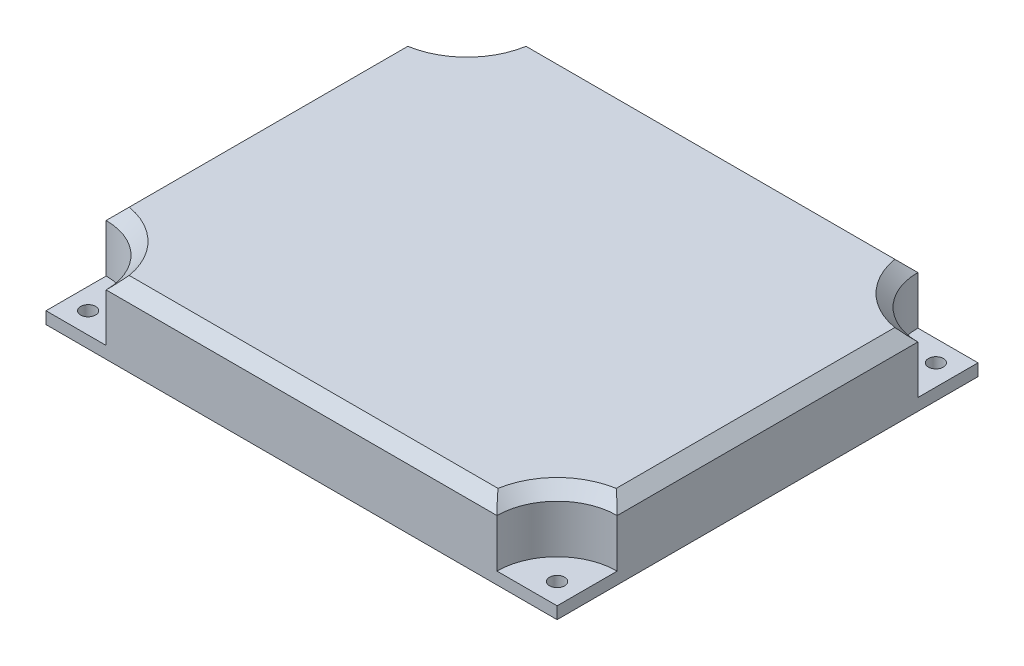
ISO-10303-21;
HEADER;
FILE_DESCRIPTION(('STEP AP214'),'2;1');
FILE_NAME('part.step','',(''),(''),'','','');
FILE_SCHEMA(('AUTOMOTIVE_DESIGN { 1 0 10303 214 1 1 1 1 }'));
ENDSEC;
DATA;
#1=APPLICATION_CONTEXT('core data for automotive mechanical design processes');
#2=APPLICATION_PROTOCOL_DEFINITION('international standard','automotive_design',2000,#1);
#3=PRODUCT_CONTEXT('',#1,'mechanical');
#4=PRODUCT('Part','Part','',(#3));
#5=PRODUCT_RELATED_PRODUCT_CATEGORY('part','',(#4));
#6=PRODUCT_DEFINITION_FORMATION('','',#4);
#7=PRODUCT_DEFINITION_CONTEXT('part definition',#1,'design');
#8=PRODUCT_DEFINITION('design','',#6,#7);
#9=PRODUCT_DEFINITION_SHAPE('','',#8);
#10=(LENGTH_UNIT() NAMED_UNIT(*) SI_UNIT(.MILLI.,.METRE.));
#11=(NAMED_UNIT(*) PLANE_ANGLE_UNIT() SI_UNIT($,.RADIAN.));
#12=(NAMED_UNIT(*) SI_UNIT($,.STERADIAN.) SOLID_ANGLE_UNIT());
#13=UNCERTAINTY_MEASURE_WITH_UNIT(LENGTH_MEASURE(1.E-05),#10,'distance_accuracy_value','');
#14=(GEOMETRIC_REPRESENTATION_CONTEXT(3) GLOBAL_UNCERTAINTY_ASSIGNED_CONTEXT((#13)) GLOBAL_UNIT_ASSIGNED_CONTEXT((#10,
#11,#12)) REPRESENTATION_CONTEXT('',''));
#15=CARTESIAN_POINT('',(0.,0.,0.));
#16=DIRECTION('',(0.,0.,1.));
#17=DIRECTION('',(1.,0.,0.));
#18=AXIS2_PLACEMENT_3D('',#15,#16,#17);
#19=CARTESIAN_POINT('',(42.5,12.,35.));
#20=DIRECTION('',(-1.,0.,0.));
#21=DIRECTION('',(0.,0.,1.));
#22=AXIS2_PLACEMENT_3D('',#19,#20,#21);
#23=PLANE('',#22);
#24=DIRECTION('',(0.,1.,0.));
#25=VECTOR('',#24,1.);
#26=CARTESIAN_POINT('',(42.5,2.,-25.));
#27=LINE('',#26,#25);
#28=CARTESIAN_POINT('',(42.5,10.,-25.));
#29=VERTEX_POINT('',#28);
#30=CARTESIAN_POINT('',(42.5,2.,-25.));
#31=VERTEX_POINT('',#30);
#32=EDGE_CURVE('E372',#29,#31,#27,.F.);
#33=ORIENTED_EDGE('',*,*,#32,.F.);
#34=DIRECTION('',(0.,0.,1.));
#35=VECTOR('',#34,1.);
#36=CARTESIAN_POINT('',(42.5,10.,35.));
#37=LINE('',#36,#35);
#38=CARTESIAN_POINT('',(42.5,10.,25.));
#39=VERTEX_POINT('',#38);
#40=EDGE_CURVE('E458',#29,#39,#37,.T.);
#41=ORIENTED_EDGE('',*,*,#40,.T.);
#42=DIRECTION('',(0.,1.,0.));
#43=VECTOR('',#42,1.);
#44=CARTESIAN_POINT('',(42.5,2.,25.));
#45=LINE('',#44,#43);
#46=CARTESIAN_POINT('',(42.5,2.,25.));
#47=VERTEX_POINT('',#46);
#48=EDGE_CURVE('E352',#39,#47,#45,.F.);
#49=ORIENTED_EDGE('',*,*,#48,.T.);
#50=DIRECTION('',(0.,0.,-1.));
#51=VECTOR('',#50,1.);
#52=CARTESIAN_POINT('',(42.5,2.,35.));
#53=LINE('',#52,#51);
#54=CARTESIAN_POINT('',(42.5,2.,35.));
#55=VERTEX_POINT('',#54);
#56=EDGE_CURVE('E375',#55,#47,#53,.T.);
#57=ORIENTED_EDGE('',*,*,#56,.F.);
#58=DIRECTION('',(0.,-1.,0.));
#59=VECTOR('',#58,1.);
#60=CARTESIAN_POINT('',(42.5,12.,35.));
#61=LINE('',#60,#59);
#62=CARTESIAN_POINT('',(42.5,0.,35.));
#63=VERTEX_POINT('',#62);
#64=EDGE_CURVE('E406',#55,#63,#61,.T.);
#65=ORIENTED_EDGE('',*,*,#64,.T.);
#66=DIRECTION('',(0.,0.,-1.));
#67=VECTOR('',#66,1.);
#68=CARTESIAN_POINT('',(42.5,0.,35.));
#69=LINE('',#68,#67);
#70=CARTESIAN_POINT('',(42.5,0.,-35.));
#71=VERTEX_POINT('',#70);
#72=EDGE_CURVE('E390',#63,#71,#69,.T.);
#73=ORIENTED_EDGE('',*,*,#72,.T.);
#74=DIRECTION('',(0.,-1.,0.));
#75=VECTOR('',#74,1.);
#76=CARTESIAN_POINT('',(42.5,12.,-35.));
#77=LINE('',#76,#75);
#78=CARTESIAN_POINT('',(42.5,2.,-35.));
#79=VERTEX_POINT('',#78);
#80=EDGE_CURVE('E415',#79,#71,#77,.T.);
#81=ORIENTED_EDGE('',*,*,#80,.F.);
#82=DIRECTION('',(0.,0.,1.));
#83=VECTOR('',#82,1.);
#84=CARTESIAN_POINT('',(42.5,2.,35.));
#85=LINE('',#84,#83);
#86=EDGE_CURVE('E386',#79,#31,#85,.T.);
#87=ORIENTED_EDGE('',*,*,#86,.T.);
#88=EDGE_LOOP('',(#33,#41,#49,#57,#65,#73,#81,#87));
#89=FACE_BOUND('',#88,.T.);
#90=ADVANCED_FACE('F43',(#89),#23,.F.);
#91=CARTESIAN_POINT('',(-42.5,12.,-35.));
#92=DIRECTION('',(0.,0.,1.));
#93=DIRECTION('',(1.,0.,0.));
#94=AXIS2_PLACEMENT_3D('',#91,#92,#93);
#95=PLANE('',#94);
#96=DIRECTION('',(0.,1.,0.));
#97=VECTOR('',#96,1.);
#98=CARTESIAN_POINT('',(-32.5,2.,-35.));
#99=LINE('',#98,#97);
#100=CARTESIAN_POINT('',(-32.5,10.,-35.));
#101=VERTEX_POINT('',#100);
#102=CARTESIAN_POINT('',(-32.5,2.,-35.));
#103=VERTEX_POINT('',#102);
#104=EDGE_CURVE('E366',#101,#103,#99,.F.);
#105=ORIENTED_EDGE('',*,*,#104,.F.);
#106=DIRECTION('',(1.,0.,0.));
#107=VECTOR('',#106,1.);
#108=CARTESIAN_POINT('',(-42.5,10.,-35.));
#109=LINE('',#108,#107);
#110=CARTESIAN_POINT('',(32.5,10.,-35.));
#111=VERTEX_POINT('',#110);
#112=EDGE_CURVE('E54',#101,#111,#109,.T.);
#113=ORIENTED_EDGE('',*,*,#112,.T.);
#114=DIRECTION('',(0.,1.,0.));
#115=VECTOR('',#114,1.);
#116=CARTESIAN_POINT('',(32.5,2.,-35.));
#117=LINE('',#116,#115);
#118=CARTESIAN_POINT('',(32.5,2.,-35.));
#119=VERTEX_POINT('',#118);
#120=EDGE_CURVE('E369',#119,#111,#117,.T.);
#121=ORIENTED_EDGE('',*,*,#120,.F.);
#122=DIRECTION('',(1.,0.,0.));
#123=VECTOR('',#122,1.);
#124=CARTESIAN_POINT('',(-42.5,2.,-35.));
#125=LINE('',#124,#123);
#126=EDGE_CURVE('E429',#119,#79,#125,.T.);
#127=ORIENTED_EDGE('',*,*,#126,.T.);
#128=ORIENTED_EDGE('',*,*,#80,.T.);
#129=DIRECTION('',(-1.,0.,0.));
#130=VECTOR('',#129,1.);
#131=CARTESIAN_POINT('',(-42.5,0.,-35.));
#132=LINE('',#131,#130);
#133=CARTESIAN_POINT('',(-42.5,0.,-35.));
#134=VERTEX_POINT('',#133);
#135=EDGE_CURVE('E394',#71,#134,#132,.T.);
#136=ORIENTED_EDGE('',*,*,#135,.T.);
#137=DIRECTION('',(0.,-1.,0.));
#138=VECTOR('',#137,1.);
#139=CARTESIAN_POINT('',(-42.5,12.,-35.));
#140=LINE('',#139,#138);
#141=CARTESIAN_POINT('',(-42.5,2.,-35.));
#142=VERTEX_POINT('',#141);
#143=EDGE_CURVE('E412',#142,#134,#140,.T.);
#144=ORIENTED_EDGE('',*,*,#143,.F.);
#145=DIRECTION('',(1.,0.,0.));
#146=VECTOR('',#145,1.);
#147=CARTESIAN_POINT('',(-42.5,2.,-35.));
#148=LINE('',#147,#146);
#149=EDGE_CURVE('E382',#142,#103,#148,.T.);
#150=ORIENTED_EDGE('',*,*,#149,.T.);
#151=EDGE_LOOP('',(#105,#113,#121,#127,#128,#136,#144,#150));
#152=FACE_BOUND('',#151,.T.);
#153=ADVANCED_FACE('F619',(#152),#95,.F.);
#154=CARTESIAN_POINT('',(-42.5,12.,35.));
#155=DIRECTION('',(1.,0.,0.));
#156=DIRECTION('',(0.,0.,-1.));
#157=AXIS2_PLACEMENT_3D('',#154,#155,#156);
#158=PLANE('',#157);
#159=DIRECTION('',(0.,1.,0.));
#160=VECTOR('',#159,1.);
#161=CARTESIAN_POINT('',(-42.5,2.,25.));
#162=LINE('',#161,#160);
#163=CARTESIAN_POINT('',(-42.5,2.,25.));
#164=VERTEX_POINT('',#163);
#165=CARTESIAN_POINT('',(-42.5,10.,25.));
#166=VERTEX_POINT('',#165);
#167=EDGE_CURVE('E358',#164,#166,#162,.T.);
#168=ORIENTED_EDGE('',*,*,#167,.T.);
#169=DIRECTION('',(0.,0.,-1.));
#170=VECTOR('',#169,1.);
#171=CARTESIAN_POINT('',(-42.5,10.,35.));
#172=LINE('',#171,#170);
#173=CARTESIAN_POINT('',(-42.5,10.,-25.));
#174=VERTEX_POINT('',#173);
#175=EDGE_CURVE('E471',#166,#174,#172,.T.);
#176=ORIENTED_EDGE('',*,*,#175,.T.);
#177=DIRECTION('',(0.,1.,0.));
#178=VECTOR('',#177,1.);
#179=CARTESIAN_POINT('',(-42.5,2.,-25.));
#180=LINE('',#179,#178);
#181=CARTESIAN_POINT('',(-42.5,2.,-25.));
#182=VERTEX_POINT('',#181);
#183=EDGE_CURVE('E362',#182,#174,#180,.T.);
#184=ORIENTED_EDGE('',*,*,#183,.F.);
#185=DIRECTION('',(0.,0.,-1.));
#186=VECTOR('',#185,1.);
#187=CARTESIAN_POINT('',(-42.5,2.,35.));
#188=LINE('',#187,#186);
#189=EDGE_CURVE('E425',#182,#142,#188,.T.);
#190=ORIENTED_EDGE('',*,*,#189,.T.);
#191=ORIENTED_EDGE('',*,*,#143,.T.);
#192=DIRECTION('',(0.,0.,1.));
#193=VECTOR('',#192,1.);
#194=CARTESIAN_POINT('',(-42.5,0.,35.));
#195=LINE('',#194,#193);
#196=CARTESIAN_POINT('',(-42.5,0.,35.));
#197=VERTEX_POINT('',#196);
#198=EDGE_CURVE('E398',#134,#197,#195,.T.);
#199=ORIENTED_EDGE('',*,*,#198,.T.);
#200=DIRECTION('',(0.,-1.,0.));
#201=VECTOR('',#200,1.);
#202=CARTESIAN_POINT('',(-42.5,12.,35.));
#203=LINE('',#202,#201);
#204=CARTESIAN_POINT('',(-42.5,2.,35.));
#205=VERTEX_POINT('',#204);
#206=EDGE_CURVE('E409',#205,#197,#203,.T.);
#207=ORIENTED_EDGE('',*,*,#206,.F.);
#208=DIRECTION('',(0.,0.,1.));
#209=VECTOR('',#208,1.);
#210=CARTESIAN_POINT('',(-42.5,2.,35.));
#211=LINE('',#210,#209);
#212=EDGE_CURVE('E379',#164,#205,#211,.T.);
#213=ORIENTED_EDGE('',*,*,#212,.F.);
#214=EDGE_LOOP('',(#168,#176,#184,#190,#191,#199,#207,#213));
#215=FACE_BOUND('',#214,.T.);
#216=ADVANCED_FACE('F639',(#215),#158,.F.);
#217=CARTESIAN_POINT('',(0.,12.,0.));
#218=DIRECTION('',(0.,-1.,0.));
#219=DIRECTION('',(0.,0.,-1.));
#220=AXIS2_PLACEMENT_3D('',#217,#218,#219);
#221=PLANE('',#220);
#222=CARTESIAN_POINT('',(42.5,12.,35.));
#223=DIRECTION('',(0.,-1.,0.));
#224=DIRECTION('',(0.,0.,-1.));
#225=AXIS2_PLACEMENT_3D('',#222,#223,#224);
#226=CIRCLE('',#225,12.);
#227=CARTESIAN_POINT('',(30.6678404338008,12.,33.));
#228=VERTEX_POINT('',#227);
#229=CARTESIAN_POINT('',(40.5,12.,23.1678404338008));
#230=VERTEX_POINT('',#229);
#231=EDGE_CURVE('E451',#228,#230,#226,.T.);
#232=ORIENTED_EDGE('',*,*,#231,.T.);
#233=DIRECTION('',(0.,0.,-1.));
#234=VECTOR('',#233,1.);
#235=CARTESIAN_POINT('',(40.5,12.,0.));
#236=LINE('',#235,#234);
#237=CARTESIAN_POINT('',(40.5,12.,-23.1678404338008));
#238=VERTEX_POINT('',#237);
#239=EDGE_CURVE('E454',#230,#238,#236,.T.);
#240=ORIENTED_EDGE('',*,*,#239,.T.);
#241=CARTESIAN_POINT('',(42.5,12.,-35.));
#242=DIRECTION('',(0.,-1.,0.));
#243=DIRECTION('',(0.,0.,-1.));
#244=AXIS2_PLACEMENT_3D('',#241,#242,#243);
#245=CIRCLE('',#244,12.);
#246=CARTESIAN_POINT('',(30.6678404338008,12.,-33.));
#247=VERTEX_POINT('',#246);
#248=EDGE_CURVE('E433',#238,#247,#245,.T.);
#249=ORIENTED_EDGE('',*,*,#248,.T.);
#250=DIRECTION('',(-1.,0.,0.));
#251=VECTOR('',#250,1.);
#252=CARTESIAN_POINT('',(0.,12.,-33.));
#253=LINE('',#252,#251);
#254=CARTESIAN_POINT('',(-30.6678404338008,12.,-33.));
#255=VERTEX_POINT('',#254);
#256=EDGE_CURVE('E436',#247,#255,#253,.T.);
#257=ORIENTED_EDGE('',*,*,#256,.T.);
#258=CARTESIAN_POINT('',(-42.5,12.,-35.));
#259=DIRECTION('',(0.,-1.,0.));
#260=DIRECTION('',(0.,0.,-1.));
#261=AXIS2_PLACEMENT_3D('',#258,#259,#260);
#262=CIRCLE('',#261,12.);
#263=CARTESIAN_POINT('',(-40.5,12.,-23.1678404338008));
#264=VERTEX_POINT('',#263);
#265=EDGE_CURVE('E439',#255,#264,#262,.T.);
#266=ORIENTED_EDGE('',*,*,#265,.T.);
#267=DIRECTION('',(0.,0.,1.));
#268=VECTOR('',#267,1.);
#269=CARTESIAN_POINT('',(-40.5,12.,0.));
#270=LINE('',#269,#268);
#271=CARTESIAN_POINT('',(-40.5,12.,23.1678404338008));
#272=VERTEX_POINT('',#271);
#273=EDGE_CURVE('E442',#264,#272,#270,.T.);
#274=ORIENTED_EDGE('',*,*,#273,.T.);
#275=CARTESIAN_POINT('',(-42.5,12.,35.));
#276=DIRECTION('',(0.,-1.,0.));
#277=DIRECTION('',(0.,0.,-1.));
#278=AXIS2_PLACEMENT_3D('',#275,#276,#277);
#279=CIRCLE('',#278,12.);
#280=CARTESIAN_POINT('',(-30.6678404338008,12.,33.));
#281=VERTEX_POINT('',#280);
#282=EDGE_CURVE('E445',#272,#281,#279,.T.);
#283=ORIENTED_EDGE('',*,*,#282,.T.);
#284=DIRECTION('',(1.,0.,0.));
#285=VECTOR('',#284,1.);
#286=CARTESIAN_POINT('',(0.,12.,33.));
#287=LINE('',#286,#285);
#288=EDGE_CURVE('E448',#281,#228,#287,.T.);
#289=ORIENTED_EDGE('',*,*,#288,.T.);
#290=EDGE_LOOP('',(#232,#240,#249,#257,#266,#274,#283,#289));
#291=FACE_BOUND('',#290,.T.);
#292=ADVANCED_FACE('F579',(#291),#221,.F.);
#293=CARTESIAN_POINT('',(-42.5,12.,35.));
#294=DIRECTION('',(0.,0.,-1.));
#295=DIRECTION('',(-1.,0.,0.));
#296=AXIS2_PLACEMENT_3D('',#293,#294,#295);
#297=PLANE('',#296);
#298=DIRECTION('',(0.,1.,0.));
#299=VECTOR('',#298,1.);
#300=CARTESIAN_POINT('',(32.5,2.,35.));
#301=LINE('',#300,#299);
#302=CARTESIAN_POINT('',(32.5,2.,35.));
#303=VERTEX_POINT('',#302);
#304=CARTESIAN_POINT('',(32.5,10.,35.));
#305=VERTEX_POINT('',#304);
#306=EDGE_CURVE('E348',#303,#305,#301,.T.);
#307=ORIENTED_EDGE('',*,*,#306,.T.);
#308=DIRECTION('',(-1.,0.,0.));
#309=VECTOR('',#308,1.);
#310=CARTESIAN_POINT('',(-42.5,10.,35.));
#311=LINE('',#310,#309);
#312=CARTESIAN_POINT('',(-32.5,10.,35.));
#313=VERTEX_POINT('',#312);
#314=EDGE_CURVE('E465',#305,#313,#311,.T.);
#315=ORIENTED_EDGE('',*,*,#314,.T.);
#316=DIRECTION('',(0.,1.,0.));
#317=VECTOR('',#316,1.);
#318=CARTESIAN_POINT('',(-32.5,2.,35.));
#319=LINE('',#318,#317);
#320=CARTESIAN_POINT('',(-32.5,2.,35.));
#321=VERTEX_POINT('',#320);
#322=EDGE_CURVE('E355',#313,#321,#319,.F.);
#323=ORIENTED_EDGE('',*,*,#322,.T.);
#324=DIRECTION('',(1.,0.,0.));
#325=VECTOR('',#324,1.);
#326=CARTESIAN_POINT('',(-42.5,2.,35.));
#327=LINE('',#326,#325);
#328=EDGE_CURVE('E421',#205,#321,#327,.T.);
#329=ORIENTED_EDGE('',*,*,#328,.F.);
#330=ORIENTED_EDGE('',*,*,#206,.T.);
#331=DIRECTION('',(1.,0.,0.));
#332=VECTOR('',#331,1.);
#333=CARTESIAN_POINT('',(-42.5,0.,35.));
#334=LINE('',#333,#332);
#335=EDGE_CURVE('E402',#197,#63,#334,.T.);
#336=ORIENTED_EDGE('',*,*,#335,.T.);
#337=ORIENTED_EDGE('',*,*,#64,.F.);
#338=DIRECTION('',(1.,0.,0.));
#339=VECTOR('',#338,1.);
#340=CARTESIAN_POINT('',(-42.5,2.,35.));
#341=LINE('',#340,#339);
#342=EDGE_CURVE('E418',#303,#55,#341,.T.);
#343=ORIENTED_EDGE('',*,*,#342,.F.);
#344=EDGE_LOOP('',(#307,#315,#323,#329,#330,#336,#337,#343));
#345=FACE_BOUND('',#344,.T.);
#346=ADVANCED_FACE('F609',(#345),#297,.F.);
#347=CARTESIAN_POINT('',(0.,0.,0.));
#348=DIRECTION('',(0.,-1.,0.));
#349=DIRECTION('',(0.,0.,-1.));
#350=AXIS2_PLACEMENT_3D('',#347,#348,#349);
#351=PLANE('',#350);
#352=CARTESIAN_POINT('',(34.95,0.,26.45));
#353=DIRECTION('',(0.,-1.,0.));
#354=DIRECTION('',(0.,0.,-1.));
#355=AXIS2_PLACEMENT_3D('',#352,#353,#354);
#356=CIRCLE('',#355,0.999999999999999);
#357=CARTESIAN_POINT('',(35.95,0.,26.45));
#358=VERTEX_POINT('',#357);
#359=CARTESIAN_POINT('',(34.95,0.,27.45));
#360=VERTEX_POINT('',#359);
#361=EDGE_CURVE('E62',#358,#360,#356,.T.);
#362=ORIENTED_EDGE('',*,*,#361,.F.);
#363=DIRECTION('',(0.,0.,1.));
#364=VECTOR('',#363,1.);
#365=CARTESIAN_POINT('',(35.95,0.,-26.45));
#366=LINE('',#365,#364);
#367=CARTESIAN_POINT('',(35.95,0.,-26.45));
#368=VERTEX_POINT('',#367);
#369=EDGE_CURVE('E232',#368,#358,#366,.T.);
#370=ORIENTED_EDGE('',*,*,#369,.F.);
#371=CARTESIAN_POINT('',(34.95,0.,-26.45));
#372=DIRECTION('',(0.,-1.,0.));
#373=DIRECTION('',(0.,0.,1.));
#374=AXIS2_PLACEMENT_3D('',#371,#372,#373);
#375=CIRCLE('',#374,0.999999999999999);
#376=CARTESIAN_POINT('',(34.95,0.,-27.45));
#377=VERTEX_POINT('',#376);
#378=EDGE_CURVE('E236',#377,#368,#375,.T.);
#379=ORIENTED_EDGE('',*,*,#378,.F.);
#380=DIRECTION('',(1.,0.,0.));
#381=VECTOR('',#380,1.);
#382=CARTESIAN_POINT('',(-34.95,0.,-27.45));
#383=LINE('',#382,#381);
#384=CARTESIAN_POINT('',(-34.95,0.,-27.45));
#385=VERTEX_POINT('',#384);
#386=EDGE_CURVE('E275',#385,#377,#383,.T.);
#387=ORIENTED_EDGE('',*,*,#386,.F.);
#388=CARTESIAN_POINT('',(-34.95,0.,-26.45));
#389=DIRECTION('',(0.,-1.,0.));
#390=DIRECTION('',(0.,0.,-1.));
#391=AXIS2_PLACEMENT_3D('',#388,#389,#390);
#392=CIRCLE('',#391,0.999999999999999);
#393=CARTESIAN_POINT('',(-35.95,0.,-26.45));
#394=VERTEX_POINT('',#393);
#395=EDGE_CURVE('E271',#394,#385,#392,.T.);
#396=ORIENTED_EDGE('',*,*,#395,.F.);
#397=DIRECTION('',(0.,0.,-1.));
#398=VECTOR('',#397,1.);
#399=CARTESIAN_POINT('',(-35.95,0.,26.45));
#400=LINE('',#399,#398);
#401=CARTESIAN_POINT('',(-35.95,0.,26.45));
#402=VERTEX_POINT('',#401);
#403=EDGE_CURVE('E267',#402,#394,#400,.T.);
#404=ORIENTED_EDGE('',*,*,#403,.F.);
#405=CARTESIAN_POINT('',(-34.95,0.,26.45));
#406=DIRECTION('',(0.,-1.,0.));
#407=DIRECTION('',(0.,0.,-1.));
#408=AXIS2_PLACEMENT_3D('',#405,#406,#407);
#409=CIRCLE('',#408,0.999999999999999);
#410=CARTESIAN_POINT('',(-34.95,0.,27.45));
#411=VERTEX_POINT('',#410);
#412=EDGE_CURVE('E263',#411,#402,#409,.T.);
#413=ORIENTED_EDGE('',*,*,#412,.F.);
#414=DIRECTION('',(-1.,0.,0.));
#415=VECTOR('',#414,1.);
#416=CARTESIAN_POINT('',(34.95,0.,27.45));
#417=LINE('',#416,#415);
#418=EDGE_CURVE('E260',#360,#411,#417,.T.);
#419=ORIENTED_EDGE('',*,*,#418,.F.);
#420=EDGE_LOOP('',(#362,#370,#379,#387,#396,#404,#413,#419));
#421=FACE_BOUND('',#420,.T.);
#422=CARTESIAN_POINT('',(-39.,0.,-31.5));
#423=DIRECTION('',(0.,-1.,0.));
#424=DIRECTION('',(0.,0.,-1.));
#425=AXIS2_PLACEMENT_3D('',#422,#423,#424);
#426=CIRCLE('',#425,1.25);
#427=CARTESIAN_POINT('',(-39.,0.,-32.75));
#428=VERTEX_POINT('',#427);
#429=EDGE_CURVE('E306',#428,#428,#426,.T.);
#430=ORIENTED_EDGE('',*,*,#429,.F.);
#431=EDGE_LOOP('',(#430));
#432=FACE_BOUND('',#431,.T.);
#433=CARTESIAN_POINT('',(-39.,0.,31.5));
#434=DIRECTION('',(0.,-1.,0.));
#435=DIRECTION('',(0.,0.,-1.));
#436=AXIS2_PLACEMENT_3D('',#433,#434,#435);
#437=CIRCLE('',#436,1.25);
#438=CARTESIAN_POINT('',(-39.,0.,30.25));
#439=VERTEX_POINT('',#438);
#440=EDGE_CURVE('E48',#439,#439,#437,.T.);
#441=ORIENTED_EDGE('',*,*,#440,.F.);
#442=EDGE_LOOP('',(#441));
#443=FACE_BOUND('',#442,.T.);
#444=CARTESIAN_POINT('',(39.,0.,31.5));
#445=DIRECTION('',(0.,-1.,0.));
#446=DIRECTION('',(0.,0.,-1.));
#447=AXIS2_PLACEMENT_3D('',#444,#445,#446);
#448=CIRCLE('',#447,1.25);
#449=CARTESIAN_POINT('',(39.,0.,30.25));
#450=VERTEX_POINT('',#449);
#451=EDGE_CURVE('E318',#450,#450,#448,.T.);
#452=ORIENTED_EDGE('',*,*,#451,.F.);
#453=EDGE_LOOP('',(#452));
#454=FACE_BOUND('',#453,.T.);
#455=CARTESIAN_POINT('',(39.,0.,-31.5));
#456=DIRECTION('',(0.,-1.,0.));
#457=DIRECTION('',(0.,0.,-1.));
#458=AXIS2_PLACEMENT_3D('',#455,#456,#457);
#459=CIRCLE('',#458,1.25);
#460=CARTESIAN_POINT('',(39.,0.,-32.75));
#461=VERTEX_POINT('',#460);
#462=EDGE_CURVE('E326',#461,#461,#459,.T.);
#463=ORIENTED_EDGE('',*,*,#462,.F.);
#464=EDGE_LOOP('',(#463));
#465=FACE_BOUND('',#464,.T.);
#466=ORIENTED_EDGE('',*,*,#72,.F.);
#467=ORIENTED_EDGE('',*,*,#335,.F.);
#468=ORIENTED_EDGE('',*,*,#198,.F.);
#469=ORIENTED_EDGE('',*,*,#135,.F.);
#470=EDGE_LOOP('',(#466,#467,#468,#469));
#471=FACE_BOUND('',#470,.T.);
#472=ADVANCED_FACE('F616',(#421,#432,#443,#454,#465,#471),#351,.T.);
#473=CARTESIAN_POINT('',(42.5,2.,35.));
#474=DIRECTION('',(0.,1.,0.));
#475=DIRECTION('',(0.,0.,1.));
#476=AXIS2_PLACEMENT_3D('',#473,#474,#475);
#477=PLANE('',#476);
#478=CARTESIAN_POINT('',(39.,2.,31.5));
#479=DIRECTION('',(0.,1.,0.));
#480=DIRECTION('',(0.,0.,1.));
#481=AXIS2_PLACEMENT_3D('',#478,#479,#480);
#482=CIRCLE('',#481,1.25);
#483=CARTESIAN_POINT('',(39.,2.,32.75));
#484=VERTEX_POINT('',#483);
#485=EDGE_CURVE('E314',#484,#484,#482,.T.);
#486=ORIENTED_EDGE('',*,*,#485,.F.);
#487=EDGE_LOOP('',(#486));
#488=FACE_BOUND('',#487,.T.);
#489=ORIENTED_EDGE('',*,*,#56,.T.);
#490=CARTESIAN_POINT('',(42.5,2.,35.));
#491=DIRECTION('',(0.,1.,0.));
#492=DIRECTION('',(0.,0.,1.));
#493=AXIS2_PLACEMENT_3D('',#490,#491,#492);
#494=CIRCLE('',#493,10.);
#495=EDGE_CURVE('E335',#47,#303,#494,.T.);
#496=ORIENTED_EDGE('',*,*,#495,.T.);
#497=ORIENTED_EDGE('',*,*,#342,.T.);
#498=EDGE_LOOP('',(#489,#496,#497));
#499=FACE_BOUND('',#498,.T.);
#500=ADVANCED_FACE('F606',(#488,#499),#477,.T.);
#501=CARTESIAN_POINT('',(42.5,2.,35.));
#502=DIRECTION('',(0.,1.,0.));
#503=DIRECTION('',(0.,0.,1.));
#504=AXIS2_PLACEMENT_3D('',#501,#502,#503);
#505=CYLINDRICAL_SURFACE('',#504,10.);
#506=ORIENTED_EDGE('',*,*,#48,.F.);
#507=CARTESIAN_POINT('',(42.5,10.,35.));
#508=DIRECTION('',(0.,-1.,0.));
#509=DIRECTION('',(0.,0.,-1.));
#510=AXIS2_PLACEMENT_3D('',#507,#508,#509);
#511=CIRCLE('',#510,10.);
#512=EDGE_CURVE('E462',#39,#305,#511,.F.);
#513=ORIENTED_EDGE('',*,*,#512,.T.);
#514=ORIENTED_EDGE('',*,*,#306,.F.);
#515=ORIENTED_EDGE('',*,*,#495,.F.);
#516=EDGE_LOOP('',(#506,#513,#514,#515));
#517=FACE_BOUND('',#516,.T.);
#518=ADVANCED_FACE('F603',(#517),#505,.F.);
#519=CARTESIAN_POINT('',(-42.5,2.,35.));
#520=DIRECTION('',(0.,1.,0.));
#521=DIRECTION('',(0.,0.,1.));
#522=AXIS2_PLACEMENT_3D('',#519,#520,#521);
#523=PLANE('',#522);
#524=CARTESIAN_POINT('',(-39.,2.,31.5));
#525=DIRECTION('',(0.,1.,0.));
#526=DIRECTION('',(0.,0.,1.));
#527=AXIS2_PLACEMENT_3D('',#524,#525,#526);
#528=CIRCLE('',#527,1.25);
#529=CARTESIAN_POINT('',(-39.,2.,32.75));
#530=VERTEX_POINT('',#529);
#531=EDGE_CURVE('E310',#530,#530,#528,.T.);
#532=ORIENTED_EDGE('',*,*,#531,.F.);
#533=EDGE_LOOP('',(#532));
#534=FACE_BOUND('',#533,.T.);
#535=ORIENTED_EDGE('',*,*,#212,.T.);
#536=ORIENTED_EDGE('',*,*,#328,.T.);
#537=CARTESIAN_POINT('',(-42.5,2.,35.));
#538=DIRECTION('',(0.,1.,0.));
#539=DIRECTION('',(0.,0.,1.));
#540=AXIS2_PLACEMENT_3D('',#537,#538,#539);
#541=CIRCLE('',#540,10.);
#542=EDGE_CURVE('E331',#321,#164,#541,.T.);
#543=ORIENTED_EDGE('',*,*,#542,.T.);
#544=EDGE_LOOP('',(#535,#536,#543));
#545=FACE_BOUND('',#544,.T.);
#546=ADVANCED_FACE('F654',(#534,#545),#523,.T.);
#547=CARTESIAN_POINT('',(-42.5,2.,35.));
#548=DIRECTION('',(0.,1.,0.));
#549=DIRECTION('',(0.,0.,1.));
#550=AXIS2_PLACEMENT_3D('',#547,#548,#549);
#551=CYLINDRICAL_SURFACE('',#550,10.);
#552=ORIENTED_EDGE('',*,*,#322,.F.);
#553=CARTESIAN_POINT('',(-42.5,10.,35.));
#554=DIRECTION('',(0.,-1.,0.));
#555=DIRECTION('',(0.,0.,-1.));
#556=AXIS2_PLACEMENT_3D('',#553,#554,#555);
#557=CIRCLE('',#556,10.);
#558=EDGE_CURVE('E468',#313,#166,#557,.F.);
#559=ORIENTED_EDGE('',*,*,#558,.T.);
#560=ORIENTED_EDGE('',*,*,#167,.F.);
#561=ORIENTED_EDGE('',*,*,#542,.F.);
#562=EDGE_LOOP('',(#552,#559,#560,#561));
#563=FACE_BOUND('',#562,.T.);
#564=ADVANCED_FACE('F677',(#563),#551,.F.);
#565=CARTESIAN_POINT('',(-42.5,2.,-35.));
#566=DIRECTION('',(0.,-1.,0.));
#567=DIRECTION('',(0.,0.,-1.));
#568=AXIS2_PLACEMENT_3D('',#565,#566,#567);
#569=PLANE('',#568);
#570=CARTESIAN_POINT('',(-39.,2.,-31.5));
#571=DIRECTION('',(0.,1.,0.));
#572=DIRECTION('',(0.,0.,1.));
#573=AXIS2_PLACEMENT_3D('',#570,#571,#572);
#574=CIRCLE('',#573,1.25);
#575=CARTESIAN_POINT('',(-39.,2.,-30.25));
#576=VERTEX_POINT('',#575);
#577=EDGE_CURVE('E285',#576,#576,#574,.T.);
#578=ORIENTED_EDGE('',*,*,#577,.F.);
#579=EDGE_LOOP('',(#578));
#580=FACE_BOUND('',#579,.T.);
#581=ORIENTED_EDGE('',*,*,#189,.F.);
#582=CARTESIAN_POINT('',(-42.5,2.,-35.));
#583=DIRECTION('',(0.,-1.,0.));
#584=DIRECTION('',(0.,0.,-1.));
#585=AXIS2_PLACEMENT_3D('',#582,#583,#584);
#586=CIRCLE('',#585,10.);
#587=EDGE_CURVE('E336',#103,#182,#586,.T.);
#588=ORIENTED_EDGE('',*,*,#587,.F.);
#589=ORIENTED_EDGE('',*,*,#149,.F.);
#590=EDGE_LOOP('',(#581,#588,#589));
#591=FACE_BOUND('',#590,.T.);
#592=ADVANCED_FACE('F680',(#580,#591),#569,.F.);
#593=CARTESIAN_POINT('',(-42.5,2.,-35.));
#594=DIRECTION('',(0.,1.,0.));
#595=DIRECTION('',(0.,0.,1.));
#596=AXIS2_PLACEMENT_3D('',#593,#594,#595);
#597=CYLINDRICAL_SURFACE('',#596,10.);
#598=ORIENTED_EDGE('',*,*,#183,.T.);
#599=CARTESIAN_POINT('',(-42.5,10.,-35.));
#600=DIRECTION('',(0.,-1.,0.));
#601=DIRECTION('',(0.,0.,-1.));
#602=AXIS2_PLACEMENT_3D('',#599,#600,#601);
#603=CIRCLE('',#602,10.);
#604=EDGE_CURVE('E474',#174,#101,#603,.F.);
#605=ORIENTED_EDGE('',*,*,#604,.T.);
#606=ORIENTED_EDGE('',*,*,#104,.T.);
#607=ORIENTED_EDGE('',*,*,#587,.T.);
#608=EDGE_LOOP('',(#598,#605,#606,#607));
#609=FACE_BOUND('',#608,.T.);
#610=ADVANCED_FACE('F631',(#609),#597,.F.);
#611=CARTESIAN_POINT('',(42.5,2.,-35.));
#612=DIRECTION('',(0.,-1.,0.));
#613=DIRECTION('',(0.,0.,-1.));
#614=AXIS2_PLACEMENT_3D('',#611,#612,#613);
#615=PLANE('',#614);
#616=CARTESIAN_POINT('',(39.,2.,-31.5));
#617=DIRECTION('',(0.,1.,0.));
#618=DIRECTION('',(0.,0.,1.));
#619=AXIS2_PLACEMENT_3D('',#616,#617,#618);
#620=CIRCLE('',#619,1.25);
#621=CARTESIAN_POINT('',(39.,2.,-30.25));
#622=VERTEX_POINT('',#621);
#623=EDGE_CURVE('E322',#622,#622,#620,.T.);
#624=ORIENTED_EDGE('',*,*,#623,.F.);
#625=EDGE_LOOP('',(#624));
#626=FACE_BOUND('',#625,.T.);
#627=ORIENTED_EDGE('',*,*,#126,.F.);
#628=CARTESIAN_POINT('',(42.5,2.,-35.));
#629=DIRECTION('',(0.,-1.,0.));
#630=DIRECTION('',(0.,0.,-1.));
#631=AXIS2_PLACEMENT_3D('',#628,#629,#630);
#632=CIRCLE('',#631,10.);
#633=EDGE_CURVE('E340',#31,#119,#632,.T.);
#634=ORIENTED_EDGE('',*,*,#633,.F.);
#635=ORIENTED_EDGE('',*,*,#86,.F.);
#636=EDGE_LOOP('',(#627,#634,#635));
#637=FACE_BOUND('',#636,.T.);
#638=ADVANCED_FACE('F622',(#626,#637),#615,.F.);
#639=CARTESIAN_POINT('',(42.5,2.,-35.));
#640=DIRECTION('',(0.,1.,0.));
#641=DIRECTION('',(0.,0.,1.));
#642=AXIS2_PLACEMENT_3D('',#639,#640,#641);
#643=CYLINDRICAL_SURFACE('',#642,10.);
#644=ORIENTED_EDGE('',*,*,#120,.T.);
#645=CARTESIAN_POINT('',(42.5,10.,-35.));
#646=DIRECTION('',(0.,-1.,0.));
#647=DIRECTION('',(0.,0.,-1.));
#648=AXIS2_PLACEMENT_3D('',#645,#646,#647);
#649=CIRCLE('',#648,10.);
#650=EDGE_CURVE('E13',#111,#29,#649,.F.);
#651=ORIENTED_EDGE('',*,*,#650,.T.);
#652=ORIENTED_EDGE('',*,*,#32,.T.);
#653=ORIENTED_EDGE('',*,*,#633,.T.);
#654=EDGE_LOOP('',(#644,#651,#652,#653));
#655=FACE_BOUND('',#654,.T.);
#656=ADVANCED_FACE('F624',(#655),#643,.F.);
#657=CARTESIAN_POINT('',(-40.5,12.,0.));
#658=DIRECTION('',(0.707106781186547,-0.707106781186548,0.));
#659=DIRECTION('',(0.,0.,1.));
#660=AXIS2_PLACEMENT_3D('',#657,#658,#659);
#661=PLANE('',#660);
#662=CARTESIAN_POINT('',(-42.5,10.,-25.));
#663=CARTESIAN_POINT('',(-42.3377757826566,10.1622242173434,-24.8377914588093));
#664=CARTESIAN_POINT('',(-42.1742534154273,10.3257465845727,-24.6782001917958));
#665=CARTESIAN_POINT('',(-41.8449471873748,10.6550528126252,-24.3639378983416));
#666=CARTESIAN_POINT('',(-41.6791641769178,10.8208358230822,-24.2092650909488));
#667=CARTESIAN_POINT('',(-41.3455660455496,11.1544339544504,-23.9044197531602));
#668=CARTESIAN_POINT('',(-41.1777510942654,11.3222489057346,-23.7542468506986));
#669=CARTESIAN_POINT('',(-40.8402276950907,11.6597723049093,-23.4580185451844));
#670=CARTESIAN_POINT('',(-40.6705185762793,11.8294814237207,-23.3119646701626));
#671=CARTESIAN_POINT('',(-40.5,12.,-23.1678404338008));
#672=B_SPLINE_CURVE_WITH_KNOTS('',3,(#662,#663,#664,#665,#666,#667,#668,#669,#670,#671),
.UNSPECIFIED.,.F.,.F.,(4,2,2,2,4),(0.,0.842879191342911,1.68544962178239,2.52795019261307,
3.37075929987768),.UNSPECIFIED.);
#673=EDGE_CURVE('E548',#174,#264,#672,.T.);
#674=ORIENTED_EDGE('',*,*,#673,.F.);
#675=ORIENTED_EDGE('',*,*,#175,.F.);
#676=CARTESIAN_POINT('',(-42.5,10.,25.));
#677=CARTESIAN_POINT('',(-42.3377757826566,10.1622242173434,24.8377914588093));
#678=CARTESIAN_POINT('',(-42.1742534154273,10.3257465845727,24.6782001917958));
#679=CARTESIAN_POINT('',(-41.8449471873748,10.6550528126252,24.3639378983416));
#680=CARTESIAN_POINT('',(-41.6791641769178,10.8208358230822,24.2092650909488));
#681=CARTESIAN_POINT('',(-41.3455660455496,11.1544339544504,23.9044197531602));
#682=CARTESIAN_POINT('',(-41.1777510942654,11.3222489057346,23.7542468506986));
#683=CARTESIAN_POINT('',(-40.8402276950907,11.6597723049093,23.4580185451844));
#684=CARTESIAN_POINT('',(-40.6705185762793,11.8294814237207,23.3119646701626));
#685=CARTESIAN_POINT('',(-40.5,12.,23.1678404338008));
#686=B_SPLINE_CURVE_WITH_KNOTS('',3,(#676,#677,#678,#679,#680,#681,#682,#683,#684,#685),
.UNSPECIFIED.,.F.,.F.,(4,2,2,2,4),(0.,0.842879191342911,1.68544962178239,2.52795019261307,
3.37075929987768),.UNSPECIFIED.);
#687=EDGE_CURVE('E344',#272,#166,#686,.F.);
#688=ORIENTED_EDGE('',*,*,#687,.F.);
#689=ORIENTED_EDGE('',*,*,#273,.F.);
#690=EDGE_LOOP('',(#674,#675,#688,#689));
#691=FACE_BOUND('',#690,.T.);
#692=ADVANCED_FACE('F45',(#691),#661,.F.);
#693=CARTESIAN_POINT('',(-42.5,10.,35.));
#694=DIRECTION('',(0.,1.,0.));
#695=DIRECTION('',(0.,0.,1.));
#696=AXIS2_PLACEMENT_3D('',#693,#694,#695);
#697=CONICAL_SURFACE('',#696,10.,0.785398163397449);
#698=ORIENTED_EDGE('',*,*,#687,.T.);
#699=ORIENTED_EDGE('',*,*,#558,.F.);
#700=CARTESIAN_POINT('',(-32.5,10.,35.));
#701=CARTESIAN_POINT('',(-32.3377914588093,10.1622242173434,34.8377757826566));
#702=CARTESIAN_POINT('',(-32.1782001917958,10.3257465845727,34.6742534154273));
#703=CARTESIAN_POINT('',(-31.8639378983416,10.6550528126252,34.3449471873748));
#704=CARTESIAN_POINT('',(-31.7092650909488,10.8208358230822,34.1791641769178));
#705=CARTESIAN_POINT('',(-31.4044197531602,11.1544339544504,33.8455660455496));
#706=CARTESIAN_POINT('',(-31.2542468506985,11.3222489057346,33.6777510942654));
#707=CARTESIAN_POINT('',(-30.9580185451844,11.6597723049093,33.3402276950907));
#708=CARTESIAN_POINT('',(-30.8119646701626,11.8294814237207,33.1705185762793));
#709=CARTESIAN_POINT('',(-30.6678404338008,12.,33.));
#710=B_SPLINE_CURVE_WITH_KNOTS('',3,(#700,#701,#702,#703,#704,#705,#706,#707,#708,#709),
.UNSPECIFIED.,.F.,.F.,(4,2,2,2,4),(0.,0.842879191342911,1.68544962178239,2.52795019261307,
3.37075929987768),.UNSPECIFIED.);
#711=EDGE_CURVE('E540',#281,#313,#710,.F.);
#712=ORIENTED_EDGE('',*,*,#711,.F.);
#713=ORIENTED_EDGE('',*,*,#282,.F.);
#714=EDGE_LOOP('',(#698,#699,#712,#713));
#715=FACE_BOUND('',#714,.T.);
#716=ADVANCED_FACE('F553',(#715),#697,.F.);
#717=CARTESIAN_POINT('',(-42.5,12.,-35.));
#718=DIRECTION('',(0.,1.,0.));
#719=DIRECTION('',(0.,0.,1.));
#720=AXIS2_PLACEMENT_3D('',#717,#718,#719);
#721=CONICAL_SURFACE('',#720,12.,0.785398163397449);
#722=ORIENTED_EDGE('',*,*,#673,.T.);
#723=ORIENTED_EDGE('',*,*,#265,.F.);
#724=CARTESIAN_POINT('',(-32.5,10.,-35.));
#725=CARTESIAN_POINT('',(-32.3377914588093,10.1622242173434,-34.8377757826566));
#726=CARTESIAN_POINT('',(-32.1782001917958,10.3257465845727,-34.6742534154273));
#727=CARTESIAN_POINT('',(-31.8639378983416,10.6550528126252,-34.3449471873748));
#728=CARTESIAN_POINT('',(-31.7092650909488,10.8208358230822,-34.1791641769178));
#729=CARTESIAN_POINT('',(-31.4044197531602,11.1544339544504,-33.8455660455496));
#730=CARTESIAN_POINT('',(-31.2542468506985,11.3222489057346,-33.6777510942654));
#731=CARTESIAN_POINT('',(-30.9580185451844,11.6597723049093,-33.3402276950907));
#732=CARTESIAN_POINT('',(-30.8119646701626,11.8294814237207,-33.1705185762793));
#733=CARTESIAN_POINT('',(-30.6678404338008,12.,-33.));
#734=B_SPLINE_CURVE_WITH_KNOTS('',3,(#724,#725,#726,#727,#728,#729,#730,#731,#732,#733),
.UNSPECIFIED.,.F.,.F.,(4,2,2,2,4),(0.,0.842879191342921,1.6854496217824,2.52795019261307,
3.37075929987768),.UNSPECIFIED.);
#735=EDGE_CURVE('E521',#101,#255,#734,.T.);
#736=ORIENTED_EDGE('',*,*,#735,.F.);
#737=ORIENTED_EDGE('',*,*,#604,.F.);
#738=EDGE_LOOP('',(#722,#723,#736,#737));
#739=FACE_BOUND('',#738,.T.);
#740=ADVANCED_FACE('F536',(#739),#721,.F.);
#741=CARTESIAN_POINT('',(0.,12.,33.));
#742=DIRECTION('',(0.,-0.707106781186548,-0.707106781186547));
#743=DIRECTION('',(1.,0.,0.));
#744=AXIS2_PLACEMENT_3D('',#741,#742,#743);
#745=PLANE('',#744);
#746=ORIENTED_EDGE('',*,*,#711,.T.);
#747=ORIENTED_EDGE('',*,*,#314,.F.);
#748=CARTESIAN_POINT('',(32.5,10.,35.));
#749=CARTESIAN_POINT('',(32.3377914588093,10.1622242173434,34.8377757826566));
#750=CARTESIAN_POINT('',(32.1782001917958,10.3257465845727,34.6742534154273));
#751=CARTESIAN_POINT('',(31.8639378983416,10.6550528126252,34.3449471873748));
#752=CARTESIAN_POINT('',(31.7092650909487,10.8208358230822,34.1791641769178));
#753=CARTESIAN_POINT('',(31.4044197531602,11.1544339544504,33.8455660455496));
#754=CARTESIAN_POINT('',(31.2542468506985,11.3222489057346,33.6777510942654));
#755=CARTESIAN_POINT('',(30.9580185451844,11.6597723049093,33.3402276950907));
#756=CARTESIAN_POINT('',(30.8119646701626,11.8294814237207,33.1705185762793));
#757=CARTESIAN_POINT('',(30.6678404338008,12.,33.));
#758=B_SPLINE_CURVE_WITH_KNOTS('',3,(#748,#749,#750,#751,#752,#753,#754,#755,#756,#757),
.UNSPECIFIED.,.F.,.F.,(4,2,2,2,4),(0.,0.842879191342911,1.68544962178239,2.52795019261307,
3.37075929987768),.UNSPECIFIED.);
#759=EDGE_CURVE('E513',#228,#305,#758,.F.);
#760=ORIENTED_EDGE('',*,*,#759,.F.);
#761=ORIENTED_EDGE('',*,*,#288,.F.);
#762=EDGE_LOOP('',(#746,#747,#760,#761));
#763=FACE_BOUND('',#762,.T.);
#764=ADVANCED_FACE('F533',(#763),#745,.F.);
#765=CARTESIAN_POINT('',(0.,12.,-33.));
#766=DIRECTION('',(0.,-0.707106781186548,0.707106781186547));
#767=DIRECTION('',(-1.,0.,0.));
#768=AXIS2_PLACEMENT_3D('',#765,#766,#767);
#769=PLANE('',#768);
#770=ORIENTED_EDGE('',*,*,#735,.T.);
#771=ORIENTED_EDGE('',*,*,#256,.F.);
#772=CARTESIAN_POINT('',(32.5,10.,-35.));
#773=CARTESIAN_POINT('',(32.3377914588093,10.1622242173434,-34.8377757826566));
#774=CARTESIAN_POINT('',(32.1782001917958,10.3257465845727,-34.6742534154273));
#775=CARTESIAN_POINT('',(31.8639378983416,10.6550528126252,-34.3449471873748));
#776=CARTESIAN_POINT('',(31.7092650909487,10.8208358230822,-34.1791641769178));
#777=CARTESIAN_POINT('',(31.4044197531602,11.1544339544504,-33.8455660455496));
#778=CARTESIAN_POINT('',(31.2542468506985,11.3222489057346,-33.6777510942654));
#779=CARTESIAN_POINT('',(30.9580185451844,11.6597723049093,-33.3402276950907));
#780=CARTESIAN_POINT('',(30.8119646701626,11.8294814237207,-33.1705185762793));
#781=CARTESIAN_POINT('',(30.6678404338008,12.,-33.));
#782=B_SPLINE_CURVE_WITH_KNOTS('',3,(#772,#773,#774,#775,#776,#777,#778,#779,#780,#781),
.UNSPECIFIED.,.F.,.F.,(4,2,2,2,4),(0.,0.842879191342912,1.68544962178239,2.52795019261306,
3.37075929987768),.UNSPECIFIED.);
#783=EDGE_CURVE('E522',#111,#247,#782,.T.);
#784=ORIENTED_EDGE('',*,*,#783,.F.);
#785=ORIENTED_EDGE('',*,*,#112,.F.);
#786=EDGE_LOOP('',(#770,#771,#784,#785));
#787=FACE_BOUND('',#786,.T.);
#788=ADVANCED_FACE('F507',(#787),#769,.F.);
#789=CARTESIAN_POINT('',(42.5,10.,35.));
#790=DIRECTION('',(0.,1.,0.));
#791=DIRECTION('',(0.,0.,1.));
#792=AXIS2_PLACEMENT_3D('',#789,#790,#791);
#793=CONICAL_SURFACE('',#792,10.,0.785398163397449);
#794=ORIENTED_EDGE('',*,*,#759,.T.);
#795=ORIENTED_EDGE('',*,*,#512,.F.);
#796=CARTESIAN_POINT('',(42.5,10.,25.));
#797=CARTESIAN_POINT('',(42.3377757826566,10.1622242173434,24.8377914588093));
#798=CARTESIAN_POINT('',(42.1742534154273,10.3257465845727,24.6782001917958));
#799=CARTESIAN_POINT('',(41.8449471873748,10.6550528126252,24.3639378983416));
#800=CARTESIAN_POINT('',(41.6791641769178,10.8208358230822,24.2092650909488));
#801=CARTESIAN_POINT('',(41.3455660455496,11.1544339544504,23.9044197531602));
#802=CARTESIAN_POINT('',(41.1777510942654,11.3222489057346,23.7542468506986));
#803=CARTESIAN_POINT('',(40.8402276950907,11.6597723049093,23.4580185451844));
#804=CARTESIAN_POINT('',(40.6705185762793,11.8294814237207,23.3119646701626));
#805=CARTESIAN_POINT('',(40.5,12.,23.1678404338008));
#806=B_SPLINE_CURVE_WITH_KNOTS('',3,(#796,#797,#798,#799,#800,#801,#802,#803,#804,#805),
.UNSPECIFIED.,.F.,.F.,(4,2,2,2,4),(0.,0.842879191342911,1.68544962178239,2.52795019261307,
3.37075929987768),.UNSPECIFIED.);
#807=EDGE_CURVE('E487',#230,#39,#806,.F.);
#808=ORIENTED_EDGE('',*,*,#807,.F.);
#809=ORIENTED_EDGE('',*,*,#231,.F.);
#810=EDGE_LOOP('',(#794,#795,#808,#809));
#811=FACE_BOUND('',#810,.T.);
#812=ADVANCED_FACE('F502',(#811),#793,.F.);
#813=CARTESIAN_POINT('',(42.5,12.,-35.));
#814=DIRECTION('',(0.,1.,0.));
#815=DIRECTION('',(0.,0.,1.));
#816=AXIS2_PLACEMENT_3D('',#813,#814,#815);
#817=CONICAL_SURFACE('',#816,12.,0.785398163397448);
#818=ORIENTED_EDGE('',*,*,#783,.T.);
#819=ORIENTED_EDGE('',*,*,#248,.F.);
#820=CARTESIAN_POINT('',(40.5,12.,-23.1678404338008));
#821=CARTESIAN_POINT('',(40.6705185762793,11.8294814237207,-23.3119646701626));
#822=CARTESIAN_POINT('',(40.8402276950907,11.6597723049093,-23.4580185451844));
#823=CARTESIAN_POINT('',(41.1777510942654,11.3222489057346,-23.7542468506986));
#824=CARTESIAN_POINT('',(41.3455660455496,11.1544339544504,-23.9044197531602));
#825=CARTESIAN_POINT('',(41.6791641769178,10.8208358230822,-24.2092650909488));
#826=CARTESIAN_POINT('',(41.8449471873748,10.6550528126252,-24.3639378983416));
#827=CARTESIAN_POINT('',(42.1742534154273,10.3257465845727,-24.6782001917958));
#828=CARTESIAN_POINT('',(42.3377757826566,10.1622242173434,-24.8377914588093));
#829=CARTESIAN_POINT('',(42.5,10.,-25.));
#830=B_SPLINE_CURVE_WITH_KNOTS('',3,(#820,#821,#822,#823,#824,#825,#826,#827,#828,#829),
.UNSPECIFIED.,.F.,.F.,(4,2,2,2,4),(0.,0.842809107264614,1.68530967809529,2.52788010853476,
3.37075929987768),.UNSPECIFIED.);
#831=EDGE_CURVE('E330',#29,#238,#830,.F.);
#832=ORIENTED_EDGE('',*,*,#831,.F.);
#833=ORIENTED_EDGE('',*,*,#650,.F.);
#834=EDGE_LOOP('',(#818,#819,#832,#833));
#835=FACE_BOUND('',#834,.T.);
#836=ADVANCED_FACE('F494',(#835),#817,.F.);
#837=CARTESIAN_POINT('',(40.5,12.,0.));
#838=DIRECTION('',(-0.707106781186547,-0.707106781186548,0.));
#839=DIRECTION('',(0.,0.,-1.));
#840=AXIS2_PLACEMENT_3D('',#837,#838,#839);
#841=PLANE('',#840);
#842=ORIENTED_EDGE('',*,*,#807,.T.);
#843=ORIENTED_EDGE('',*,*,#40,.F.);
#844=ORIENTED_EDGE('',*,*,#831,.T.);
#845=ORIENTED_EDGE('',*,*,#239,.F.);
#846=EDGE_LOOP('',(#842,#843,#844,#845));
#847=FACE_BOUND('',#846,.T.);
#848=ADVANCED_FACE('F497',(#847),#841,.F.);
#849=CARTESIAN_POINT('',(39.,2.,-31.5));
#850=DIRECTION('',(0.,1.,0.));
#851=DIRECTION('',(0.,0.,1.));
#852=AXIS2_PLACEMENT_3D('',#849,#850,#851);
#853=CYLINDRICAL_SURFACE('',#852,1.25);
#854=ORIENTED_EDGE('',*,*,#462,.T.);
#855=EDGE_LOOP('',(#854));
#856=FACE_BOUND('',#855,.T.);
#857=ORIENTED_EDGE('',*,*,#623,.T.);
#858=EDGE_LOOP('',(#857));
#859=FACE_BOUND('',#858,.T.);
#860=ADVANCED_FACE('F500',(#856,#859),#853,.F.);
#861=CARTESIAN_POINT('',(39.,2.,31.5));
#862=DIRECTION('',(0.,1.,0.));
#863=DIRECTION('',(0.,0.,1.));
#864=AXIS2_PLACEMENT_3D('',#861,#862,#863);
#865=CYLINDRICAL_SURFACE('',#864,1.25);
#866=ORIENTED_EDGE('',*,*,#451,.T.);
#867=EDGE_LOOP('',(#866));
#868=FACE_BOUND('',#867,.T.);
#869=ORIENTED_EDGE('',*,*,#485,.T.);
#870=EDGE_LOOP('',(#869));
#871=FACE_BOUND('',#870,.T.);
#872=ADVANCED_FACE('F661',(#868,#871),#865,.F.);
#873=CARTESIAN_POINT('',(-39.,2.,31.5));
#874=DIRECTION('',(0.,1.,0.));
#875=DIRECTION('',(0.,0.,1.));
#876=AXIS2_PLACEMENT_3D('',#873,#874,#875);
#877=CYLINDRICAL_SURFACE('',#876,1.25);
#878=ORIENTED_EDGE('',*,*,#440,.T.);
#879=EDGE_LOOP('',(#878));
#880=FACE_BOUND('',#879,.T.);
#881=ORIENTED_EDGE('',*,*,#531,.T.);
#882=EDGE_LOOP('',(#881));
#883=FACE_BOUND('',#882,.T.);
#884=ADVANCED_FACE('F663',(#880,#883),#877,.F.);
#885=CARTESIAN_POINT('',(-39.,2.,-31.5));
#886=DIRECTION('',(0.,1.,0.));
#887=DIRECTION('',(0.,0.,1.));
#888=AXIS2_PLACEMENT_3D('',#885,#886,#887);
#889=CYLINDRICAL_SURFACE('',#888,1.25);
#890=ORIENTED_EDGE('',*,*,#429,.T.);
#891=EDGE_LOOP('',(#890));
#892=FACE_BOUND('',#891,.T.);
#893=ORIENTED_EDGE('',*,*,#577,.T.);
#894=EDGE_LOOP('',(#893));
#895=FACE_BOUND('',#894,.T.);
#896=ADVANCED_FACE('F670',(#892,#895),#889,.F.);
#897=CARTESIAN_POINT('',(34.95,8.,26.45));
#898=DIRECTION('',(0.,-1.,0.));
#899=DIRECTION('',(0.,0.,-1.));
#900=AXIS2_PLACEMENT_3D('',#897,#898,#899);
#901=CYLINDRICAL_SURFACE('',#900,0.999999999999999);
#902=ORIENTED_EDGE('',*,*,#361,.T.);
#903=DIRECTION('',(0.,-1.,0.));
#904=VECTOR('',#903,1.);
#905=CARTESIAN_POINT('',(34.95,8.,27.45));
#906=LINE('',#905,#904);
#907=CARTESIAN_POINT('',(34.95,8.,27.45));
#908=VERTEX_POINT('',#907);
#909=EDGE_CURVE('E206',#908,#360,#906,.T.);
#910=ORIENTED_EDGE('',*,*,#909,.F.);
#911=CARTESIAN_POINT('',(34.95,8.,26.45));
#912=DIRECTION('',(0.,-1.,0.));
#913=DIRECTION('',(0.,0.,-1.));
#914=AXIS2_PLACEMENT_3D('',#911,#912,#913);
#915=CIRCLE('',#914,0.999999999999999);
#916=CARTESIAN_POINT('',(35.95,8.,26.45));
#917=VERTEX_POINT('',#916);
#918=EDGE_CURVE('E210',#917,#908,#915,.T.);
#919=ORIENTED_EDGE('',*,*,#918,.F.);
#920=DIRECTION('',(0.,-1.,0.));
#921=VECTOR('',#920,1.);
#922=CARTESIAN_POINT('',(35.95,8.,26.45));
#923=LINE('',#922,#921);
#924=EDGE_CURVE('E282',#917,#358,#923,.T.);
#925=ORIENTED_EDGE('',*,*,#924,.T.);
#926=EDGE_LOOP('',(#902,#910,#919,#925));
#927=FACE_BOUND('',#926,.T.);
#928=ADVANCED_FACE('F208',(#927),#901,.F.);
#929=CARTESIAN_POINT('',(35.95,8.,-26.45));
#930=DIRECTION('',(1.,0.,0.));
#931=DIRECTION('',(0.,0.,-1.));
#932=AXIS2_PLACEMENT_3D('',#929,#930,#931);
#933=PLANE('',#932);
#934=ORIENTED_EDGE('',*,*,#369,.T.);
#935=ORIENTED_EDGE('',*,*,#924,.F.);
#936=DIRECTION('',(0.,0.,1.));
#937=VECTOR('',#936,1.);
#938=CARTESIAN_POINT('',(35.95,8.,-26.45));
#939=LINE('',#938,#937);
#940=CARTESIAN_POINT('',(35.95,8.,-26.45));
#941=VERTEX_POINT('',#940);
#942=EDGE_CURVE('E217',#941,#917,#939,.T.);
#943=ORIENTED_EDGE('',*,*,#942,.F.);
#944=DIRECTION('',(0.,-1.,0.));
#945=VECTOR('',#944,1.);
#946=CARTESIAN_POINT('',(35.95,8.,-26.45));
#947=LINE('',#946,#945);
#948=EDGE_CURVE('E286',#941,#368,#947,.T.);
#949=ORIENTED_EDGE('',*,*,#948,.T.);
#950=EDGE_LOOP('',(#934,#935,#943,#949));
#951=FACE_BOUND('',#950,.T.);
#952=ADVANCED_FACE('F709',(#951),#933,.F.);
#953=CARTESIAN_POINT('',(34.95,8.,-26.45));
#954=DIRECTION('',(0.,-1.,0.));
#955=DIRECTION('',(0.,0.,-1.));
#956=AXIS2_PLACEMENT_3D('',#953,#954,#955);
#957=CYLINDRICAL_SURFACE('',#956,0.999999999999999);
#958=ORIENTED_EDGE('',*,*,#378,.T.);
#959=ORIENTED_EDGE('',*,*,#948,.F.);
#960=CARTESIAN_POINT('',(34.95,8.,-26.45));
#961=DIRECTION('',(0.,-1.,0.));
#962=DIRECTION('',(0.,0.,1.));
#963=AXIS2_PLACEMENT_3D('',#960,#961,#962);
#964=CIRCLE('',#963,0.999999999999999);
#965=CARTESIAN_POINT('',(34.95,8.,-27.45));
#966=VERTEX_POINT('',#965);
#967=EDGE_CURVE('E253',#966,#941,#964,.T.);
#968=ORIENTED_EDGE('',*,*,#967,.F.);
#969=DIRECTION('',(0.,-1.,0.));
#970=VECTOR('',#969,1.);
#971=CARTESIAN_POINT('',(34.95,8.,-27.45));
#972=LINE('',#971,#970);
#973=EDGE_CURVE('E289',#966,#377,#972,.T.);
#974=ORIENTED_EDGE('',*,*,#973,.T.);
#975=EDGE_LOOP('',(#958,#959,#968,#974));
#976=FACE_BOUND('',#975,.T.);
#977=ADVANCED_FACE('F729',(#976),#957,.F.);
#978=CARTESIAN_POINT('',(-34.95,8.,-27.45));
#979=DIRECTION('',(0.,0.,-1.));
#980=DIRECTION('',(-1.,0.,0.));
#981=AXIS2_PLACEMENT_3D('',#978,#979,#980);
#982=PLANE('',#981);
#983=ORIENTED_EDGE('',*,*,#386,.T.);
#984=ORIENTED_EDGE('',*,*,#973,.F.);
#985=DIRECTION('',(1.,0.,0.));
#986=VECTOR('',#985,1.);
#987=CARTESIAN_POINT('',(-34.95,8.,-27.45));
#988=LINE('',#987,#986);
#989=CARTESIAN_POINT('',(-34.95,8.,-27.45));
#990=VERTEX_POINT('',#989);
#991=EDGE_CURVE('E249',#990,#966,#988,.T.);
#992=ORIENTED_EDGE('',*,*,#991,.F.);
#993=DIRECTION('',(0.,-1.,0.));
#994=VECTOR('',#993,1.);
#995=CARTESIAN_POINT('',(-34.95,8.,-27.45));
#996=LINE('',#995,#994);
#997=EDGE_CURVE('E292',#990,#385,#996,.T.);
#998=ORIENTED_EDGE('',*,*,#997,.T.);
#999=EDGE_LOOP('',(#983,#984,#992,#998));
#1000=FACE_BOUND('',#999,.T.);
#1001=ADVANCED_FACE('F725',(#1000),#982,.F.);
#1002=CARTESIAN_POINT('',(-34.95,8.,-26.45));
#1003=DIRECTION('',(0.,-1.,0.));
#1004=DIRECTION('',(0.,0.,-1.));
#1005=AXIS2_PLACEMENT_3D('',#1002,#1003,#1004);
#1006=CYLINDRICAL_SURFACE('',#1005,0.999999999999999);
#1007=ORIENTED_EDGE('',*,*,#395,.T.);
#1008=ORIENTED_EDGE('',*,*,#997,.F.);
#1009=CARTESIAN_POINT('',(-34.95,8.,-26.45));
#1010=DIRECTION('',(0.,-1.,0.));
#1011=DIRECTION('',(0.,0.,-1.));
#1012=AXIS2_PLACEMENT_3D('',#1009,#1010,#1011);
#1013=CIRCLE('',#1012,0.999999999999999);
#1014=CARTESIAN_POINT('',(-35.95,8.,-26.45));
#1015=VERTEX_POINT('',#1014);
#1016=EDGE_CURVE('E245',#1015,#990,#1013,.T.);
#1017=ORIENTED_EDGE('',*,*,#1016,.F.);
#1018=DIRECTION('',(0.,-1.,0.));
#1019=VECTOR('',#1018,1.);
#1020=CARTESIAN_POINT('',(-35.95,8.,-26.45));
#1021=LINE('',#1020,#1019);
#1022=EDGE_CURVE('E295',#1015,#394,#1021,.T.);
#1023=ORIENTED_EDGE('',*,*,#1022,.T.);
#1024=EDGE_LOOP('',(#1007,#1008,#1017,#1023));
#1025=FACE_BOUND('',#1024,.T.);
#1026=ADVANCED_FACE('F721',(#1025),#1006,.F.);
#1027=CARTESIAN_POINT('',(-35.95,8.,26.45));
#1028=DIRECTION('',(-1.,0.,0.));
#1029=DIRECTION('',(0.,0.,1.));
#1030=AXIS2_PLACEMENT_3D('',#1027,#1028,#1029);
#1031=PLANE('',#1030);
#1032=ORIENTED_EDGE('',*,*,#403,.T.);
#1033=ORIENTED_EDGE('',*,*,#1022,.F.);
#1034=DIRECTION('',(0.,0.,-1.));
#1035=VECTOR('',#1034,1.);
#1036=CARTESIAN_POINT('',(-35.95,8.,26.45));
#1037=LINE('',#1036,#1035);
#1038=CARTESIAN_POINT('',(-35.95,8.,26.45));
#1039=VERTEX_POINT('',#1038);
#1040=EDGE_CURVE('E241',#1039,#1015,#1037,.T.);
#1041=ORIENTED_EDGE('',*,*,#1040,.F.);
#1042=DIRECTION('',(0.,-1.,0.));
#1043=VECTOR('',#1042,1.);
#1044=CARTESIAN_POINT('',(-35.95,8.,26.45));
#1045=LINE('',#1044,#1043);
#1046=EDGE_CURVE('E298',#1039,#402,#1045,.T.);
#1047=ORIENTED_EDGE('',*,*,#1046,.T.);
#1048=EDGE_LOOP('',(#1032,#1033,#1041,#1047));
#1049=FACE_BOUND('',#1048,.T.);
#1050=ADVANCED_FACE('F717',(#1049),#1031,.F.);
#1051=CARTESIAN_POINT('',(-34.95,8.,26.45));
#1052=DIRECTION('',(0.,-1.,0.));
#1053=DIRECTION('',(0.,0.,-1.));
#1054=AXIS2_PLACEMENT_3D('',#1051,#1052,#1053);
#1055=CYLINDRICAL_SURFACE('',#1054,0.999999999999999);
#1056=ORIENTED_EDGE('',*,*,#412,.T.);
#1057=ORIENTED_EDGE('',*,*,#1046,.F.);
#1058=CARTESIAN_POINT('',(-34.95,8.,26.45));
#1059=DIRECTION('',(0.,-1.,0.));
#1060=DIRECTION('',(0.,0.,-1.));
#1061=AXIS2_PLACEMENT_3D('',#1058,#1059,#1060);
#1062=CIRCLE('',#1061,0.999999999999999);
#1063=CARTESIAN_POINT('',(-34.95,8.,27.45));
#1064=VERTEX_POINT('',#1063);
#1065=EDGE_CURVE('E226',#1064,#1039,#1062,.T.);
#1066=ORIENTED_EDGE('',*,*,#1065,.F.);
#1067=DIRECTION('',(0.,-1.,0.));
#1068=VECTOR('',#1067,1.);
#1069=CARTESIAN_POINT('',(-34.95,8.,27.45));
#1070=LINE('',#1069,#1068);
#1071=EDGE_CURVE('E216',#1064,#411,#1070,.T.);
#1072=ORIENTED_EDGE('',*,*,#1071,.T.);
#1073=EDGE_LOOP('',(#1056,#1057,#1066,#1072));
#1074=FACE_BOUND('',#1073,.T.);
#1075=ADVANCED_FACE('F714',(#1074),#1055,.F.);
#1076=CARTESIAN_POINT('',(34.95,8.,27.45));
#1077=DIRECTION('',(0.,0.,1.));
#1078=DIRECTION('',(1.,0.,0.));
#1079=AXIS2_PLACEMENT_3D('',#1076,#1077,#1078);
#1080=PLANE('',#1079);
#1081=ORIENTED_EDGE('',*,*,#418,.T.);
#1082=ORIENTED_EDGE('',*,*,#1071,.F.);
#1083=DIRECTION('',(-1.,0.,0.));
#1084=VECTOR('',#1083,1.);
#1085=CARTESIAN_POINT('',(34.95,8.,27.45));
#1086=LINE('',#1085,#1084);
#1087=EDGE_CURVE('E220',#908,#1064,#1086,.T.);
#1088=ORIENTED_EDGE('',*,*,#1087,.F.);
#1089=ORIENTED_EDGE('',*,*,#909,.T.);
#1090=EDGE_LOOP('',(#1081,#1082,#1088,#1089));
#1091=FACE_BOUND('',#1090,.T.);
#1092=ADVANCED_FACE('F221',(#1091),#1080,.F.);
#1093=CARTESIAN_POINT('',(34.95,8.,26.45));
#1094=DIRECTION('',(0.,-1.,0.));
#1095=DIRECTION('',(0.,0.,-1.));
#1096=AXIS2_PLACEMENT_3D('',#1093,#1094,#1095);
#1097=PLANE('',#1096);
#1098=ORIENTED_EDGE('',*,*,#918,.T.);
#1099=ORIENTED_EDGE('',*,*,#1087,.T.);
#1100=ORIENTED_EDGE('',*,*,#1065,.T.);
#1101=ORIENTED_EDGE('',*,*,#1040,.T.);
#1102=ORIENTED_EDGE('',*,*,#1016,.T.);
#1103=ORIENTED_EDGE('',*,*,#991,.T.);
#1104=ORIENTED_EDGE('',*,*,#967,.T.);
#1105=ORIENTED_EDGE('',*,*,#942,.T.);
#1106=EDGE_LOOP('',(#1098,#1099,#1100,#1101,#1102,#1103,#1104,#1105));
#1107=FACE_BOUND('',#1106,.T.);
#1108=ADVANCED_FACE('F228',(#1107),#1097,.T.);
#1109=CLOSED_SHELL('',(#90,#153,#216,#292,#346,#472,#500,#518,#546,#564,#592,#610,#638,#656,
#692,#716,#740,#764,#788,#812,#836,#848,#860,#872,#884,#896,#928,#952,#977,#1001,#1026,#1050,
#1075,#1092,#1108));
#1110=MANIFOLD_SOLID_BREP('B2',#1109);
#1111=ADVANCED_BREP_SHAPE_REPRESENTATION('',(#18,#1110),#14);
#1112=SHAPE_DEFINITION_REPRESENTATION(#9,#1111);
ENDSEC;
END-ISO-10303-21;
